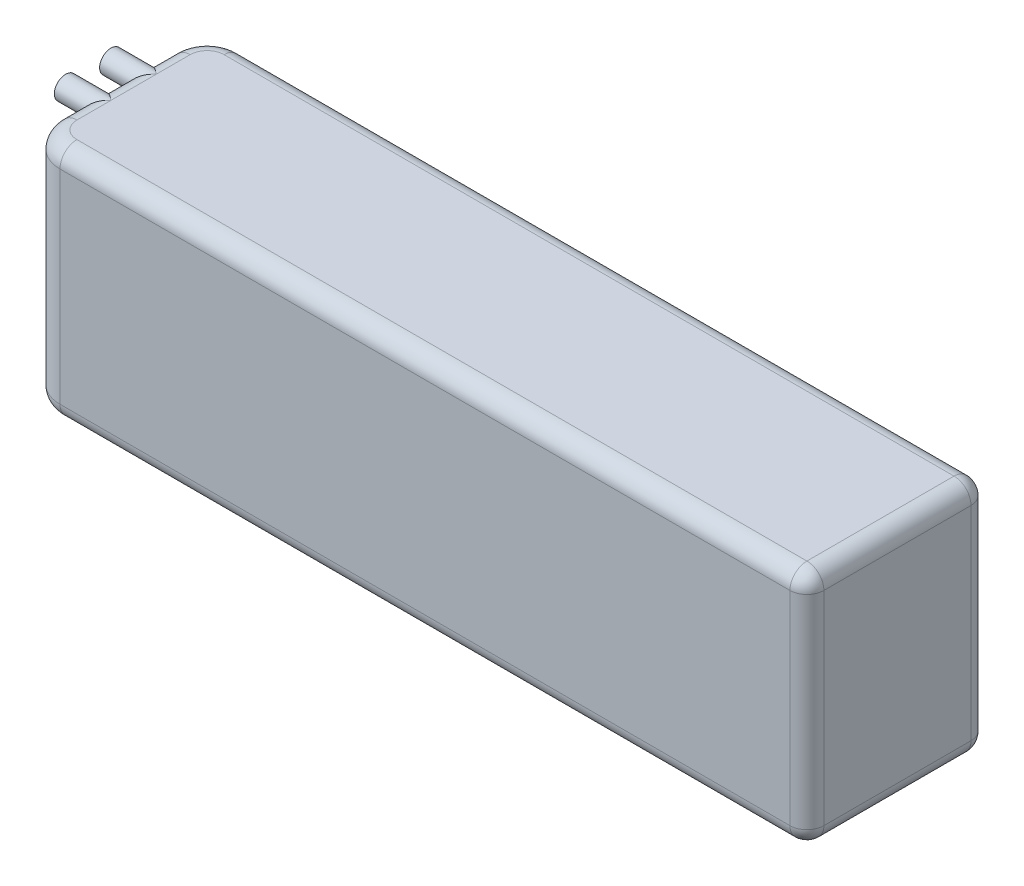
ISO-10303-21;
HEADER;
FILE_DESCRIPTION(('STEP AP214'),'2;1');
FILE_NAME('part.step','',(''),(''),'','','');
FILE_SCHEMA(('AUTOMOTIVE_DESIGN { 1 0 10303 214 1 1 1 1 }'));
ENDSEC;
DATA;
#1=APPLICATION_CONTEXT('core data for automotive mechanical design processes');
#2=APPLICATION_PROTOCOL_DEFINITION('international standard','automotive_design',2000,#1);
#3=PRODUCT_CONTEXT('',#1,'mechanical');
#4=PRODUCT('Part','Part','',(#3));
#5=PRODUCT_RELATED_PRODUCT_CATEGORY('part','',(#4));
#6=PRODUCT_DEFINITION_FORMATION('','',#4);
#7=PRODUCT_DEFINITION_CONTEXT('part definition',#1,'design');
#8=PRODUCT_DEFINITION('design','',#6,#7);
#9=PRODUCT_DEFINITION_SHAPE('','',#8);
#10=(LENGTH_UNIT() NAMED_UNIT(*) SI_UNIT(.MILLI.,.METRE.));
#11=(NAMED_UNIT(*) PLANE_ANGLE_UNIT() SI_UNIT($,.RADIAN.));
#12=(NAMED_UNIT(*) SI_UNIT($,.STERADIAN.) SOLID_ANGLE_UNIT());
#13=UNCERTAINTY_MEASURE_WITH_UNIT(LENGTH_MEASURE(1.E-05),#10,'distance_accuracy_value','');
#14=(GEOMETRIC_REPRESENTATION_CONTEXT(3) GLOBAL_UNCERTAINTY_ASSIGNED_CONTEXT((#13)) GLOBAL_UNIT_ASSIGNED_CONTEXT((#10,
#11,#12)) REPRESENTATION_CONTEXT('',''));
#15=CARTESIAN_POINT('',(0.,0.,0.));
#16=DIRECTION('',(0.,0.,1.));
#17=DIRECTION('',(1.,0.,0.));
#18=AXIS2_PLACEMENT_3D('',#15,#16,#17);
#19=CARTESIAN_POINT('',(0.,42.,0.));
#20=DIRECTION('',(1.,0.,0.));
#21=DIRECTION('',(0.,0.,-1.));
#22=AXIS2_PLACEMENT_3D('',#19,#20,#21);
#23=PLANE('',#22);
#24=DIRECTION('',(0.,-1.,0.));
#25=VECTOR('',#24,1.);
#26=CARTESIAN_POINT('',(0.,42.,-6.));
#27=LINE('',#26,#25);
#28=CARTESIAN_POINT('',(0.,3.,-6.));
#29=VERTEX_POINT('',#28);
#30=CARTESIAN_POINT('',(0.,39.,-6.));
#31=VERTEX_POINT('',#30);
#32=EDGE_CURVE('E599',#29,#31,#27,.F.);
#33=ORIENTED_EDGE('',*,*,#32,.T.);
#34=DIRECTION('',(0.,0.,1.));
#35=VECTOR('',#34,1.);
#36=CARTESIAN_POINT('',(0.,39.,0.));
#37=LINE('',#36,#35);
#38=CARTESIAN_POINT('',(0.,39.,-10.2679491924311));
#39=VERTEX_POINT('',#38);
#40=EDGE_CURVE('E197',#31,#39,#37,.F.);
#41=ORIENTED_EDGE('',*,*,#40,.T.);
#42=CARTESIAN_POINT('',(0.,40.,-12.));
#43=DIRECTION('',(-1.,0.,0.));
#44=DIRECTION('',(0.,0.,1.));
#45=AXIS2_PLACEMENT_3D('',#42,#43,#44);
#46=CIRCLE('',#45,2.);
#47=CARTESIAN_POINT('',(0.,39.,-13.7320508075689));
#48=VERTEX_POINT('',#47);
#49=EDGE_CURVE('E594',#48,#39,#46,.T.);
#50=ORIENTED_EDGE('',*,*,#49,.F.);
#51=DIRECTION('',(0.,0.,1.));
#52=VECTOR('',#51,1.);
#53=CARTESIAN_POINT('',(0.,39.,0.));
#54=LINE('',#53,#52);
#55=CARTESIAN_POINT('',(0.,39.,-18.2679491924311));
#56=VERTEX_POINT('',#55);
#57=EDGE_CURVE('E195',#48,#56,#54,.F.);
#58=ORIENTED_EDGE('',*,*,#57,.T.);
#59=CARTESIAN_POINT('',(0.,40.,-20.));
#60=DIRECTION('',(-1.,0.,0.));
#61=DIRECTION('',(0.,0.,1.));
#62=AXIS2_PLACEMENT_3D('',#59,#60,#61);
#63=CIRCLE('',#62,2.00000000000001);
#64=CARTESIAN_POINT('',(0.,39.,-21.7320508075689));
#65=VERTEX_POINT('',#64);
#66=EDGE_CURVE('E586',#65,#56,#63,.T.);
#67=ORIENTED_EDGE('',*,*,#66,.F.);
#68=DIRECTION('',(0.,0.,1.));
#69=VECTOR('',#68,1.);
#70=CARTESIAN_POINT('',(0.,39.,0.));
#71=LINE('',#70,#69);
#72=CARTESIAN_POINT('',(0.,39.,-26.));
#73=VERTEX_POINT('',#72);
#74=EDGE_CURVE('E193',#65,#73,#71,.F.);
#75=ORIENTED_EDGE('',*,*,#74,.T.);
#76=DIRECTION('',(0.,-1.,0.));
#77=VECTOR('',#76,1.);
#78=CARTESIAN_POINT('',(0.,42.,-26.));
#79=LINE('',#78,#77);
#80=CARTESIAN_POINT('',(0.,3.,-26.));
#81=VERTEX_POINT('',#80);
#82=EDGE_CURVE('E602',#73,#81,#79,.T.);
#83=ORIENTED_EDGE('',*,*,#82,.T.);
#84=DIRECTION('',(0.,0.,1.));
#85=VECTOR('',#84,1.);
#86=CARTESIAN_POINT('',(0.,3.,-6.));
#87=LINE('',#86,#85);
#88=EDGE_CURVE('E191',#81,#29,#87,.T.);
#89=ORIENTED_EDGE('',*,*,#88,.T.);
#90=EDGE_LOOP('',(#33,#41,#50,#58,#67,#75,#83,#89));
#91=FACE_BOUND('',#90,.T.);
#92=ADVANCED_FACE('F36',(#91),#23,.F.);
#93=CARTESIAN_POINT('',(0.,42.,0.));
#94=DIRECTION('',(0.,0.,-1.));
#95=DIRECTION('',(-1.,0.,0.));
#96=AXIS2_PLACEMENT_3D('',#93,#94,#95);
#97=PLANE('',#96);
#98=DIRECTION('',(0.,-1.,0.));
#99=VECTOR('',#98,1.);
#100=CARTESIAN_POINT('',(135.,42.,0.));
#101=LINE('',#100,#99);
#102=CARTESIAN_POINT('',(135.,3.,0.));
#103=VERTEX_POINT('',#102);
#104=CARTESIAN_POINT('',(135.,39.,0.));
#105=VERTEX_POINT('',#104);
#106=EDGE_CURVE('E220',#103,#105,#101,.F.);
#107=ORIENTED_EDGE('',*,*,#106,.T.);
#108=DIRECTION('',(1.,0.,0.));
#109=VECTOR('',#108,1.);
#110=CARTESIAN_POINT('',(0.,39.,0.));
#111=LINE('',#110,#109);
#112=CARTESIAN_POINT('',(6.,39.,0.));
#113=VERTEX_POINT('',#112);
#114=EDGE_CURVE('E222',#105,#113,#111,.F.);
#115=ORIENTED_EDGE('',*,*,#114,.T.);
#116=DIRECTION('',(0.,-1.,0.));
#117=VECTOR('',#116,1.);
#118=CARTESIAN_POINT('',(6.,42.,0.));
#119=LINE('',#118,#117);
#120=CARTESIAN_POINT('',(6.,3.,0.));
#121=VERTEX_POINT('',#120);
#122=EDGE_CURVE('E177',#113,#121,#119,.T.);
#123=ORIENTED_EDGE('',*,*,#122,.T.);
#124=DIRECTION('',(1.,0.,0.));
#125=VECTOR('',#124,1.);
#126=CARTESIAN_POINT('',(138.,3.,0.));
#127=LINE('',#126,#125);
#128=EDGE_CURVE('E218',#121,#103,#127,.T.);
#129=ORIENTED_EDGE('',*,*,#128,.T.);
#130=EDGE_LOOP('',(#107,#115,#123,#129));
#131=FACE_BOUND('',#130,.T.);
#132=ADVANCED_FACE('F300',(#131),#97,.F.);
#133=CARTESIAN_POINT('',(138.,42.,0.));
#134=DIRECTION('',(-1.,0.,0.));
#135=DIRECTION('',(0.,0.,1.));
#136=AXIS2_PLACEMENT_3D('',#133,#134,#135);
#137=PLANE('',#136);
#138=DIRECTION('',(0.,-1.,0.));
#139=VECTOR('',#138,1.);
#140=CARTESIAN_POINT('',(138.,42.,-29.));
#141=LINE('',#140,#139);
#142=CARTESIAN_POINT('',(138.,3.,-29.));
#143=VERTEX_POINT('',#142);
#144=CARTESIAN_POINT('',(138.,39.,-29.));
#145=VERTEX_POINT('',#144);
#146=EDGE_CURVE('E213',#143,#145,#141,.F.);
#147=ORIENTED_EDGE('',*,*,#146,.T.);
#148=DIRECTION('',(0.,0.,-1.));
#149=VECTOR('',#148,1.);
#150=CARTESIAN_POINT('',(138.,39.,0.));
#151=LINE('',#150,#149);
#152=CARTESIAN_POINT('',(138.,39.,-3.));
#153=VERTEX_POINT('',#152);
#154=EDGE_CURVE('E215',#145,#153,#151,.F.);
#155=ORIENTED_EDGE('',*,*,#154,.T.);
#156=DIRECTION('',(0.,-1.,0.));
#157=VECTOR('',#156,1.);
#158=CARTESIAN_POINT('',(138.,42.,-3.));
#159=LINE('',#158,#157);
#160=CARTESIAN_POINT('',(138.,3.,-3.));
#161=VERTEX_POINT('',#160);
#162=EDGE_CURVE('E211',#153,#161,#159,.T.);
#163=ORIENTED_EDGE('',*,*,#162,.T.);
#164=DIRECTION('',(0.,0.,-1.));
#165=VECTOR('',#164,1.);
#166=CARTESIAN_POINT('',(138.,3.,-32.));
#167=LINE('',#166,#165);
#168=EDGE_CURVE('E209',#161,#143,#167,.T.);
#169=ORIENTED_EDGE('',*,*,#168,.T.);
#170=EDGE_LOOP('',(#147,#155,#163,#169));
#171=FACE_BOUND('',#170,.T.);
#172=ADVANCED_FACE('F306',(#171),#137,.F.);
#173=CARTESIAN_POINT('',(0.,42.,-32.));
#174=DIRECTION('',(0.,0.,1.));
#175=DIRECTION('',(1.,0.,0.));
#176=AXIS2_PLACEMENT_3D('',#173,#174,#175);
#177=PLANE('',#176);
#178=DIRECTION('',(0.,-1.,0.));
#179=VECTOR('',#178,1.);
#180=CARTESIAN_POINT('',(6.,42.,-32.));
#181=LINE('',#180,#179);
#182=CARTESIAN_POINT('',(6.,3.,-32.));
#183=VERTEX_POINT('',#182);
#184=CARTESIAN_POINT('',(6.,39.,-32.));
#185=VERTEX_POINT('',#184);
#186=EDGE_CURVE('E605',#183,#185,#181,.F.);
#187=ORIENTED_EDGE('',*,*,#186,.T.);
#188=DIRECTION('',(-1.,0.,0.));
#189=VECTOR('',#188,1.);
#190=CARTESIAN_POINT('',(0.,39.,-32.));
#191=LINE('',#190,#189);
#192=CARTESIAN_POINT('',(135.,39.,-32.));
#193=VERTEX_POINT('',#192);
#194=EDGE_CURVE('E207',#185,#193,#191,.F.);
#195=ORIENTED_EDGE('',*,*,#194,.T.);
#196=DIRECTION('',(0.,-1.,0.));
#197=VECTOR('',#196,1.);
#198=CARTESIAN_POINT('',(135.,42.,-32.));
#199=LINE('',#198,#197);
#200=CARTESIAN_POINT('',(135.,3.,-32.));
#201=VERTEX_POINT('',#200);
#202=EDGE_CURVE('E205',#193,#201,#199,.T.);
#203=ORIENTED_EDGE('',*,*,#202,.T.);
#204=DIRECTION('',(-1.,0.,0.));
#205=VECTOR('',#204,1.);
#206=CARTESIAN_POINT('',(6.,3.,-32.));
#207=LINE('',#206,#205);
#208=EDGE_CURVE('E203',#201,#183,#207,.T.);
#209=ORIENTED_EDGE('',*,*,#208,.T.);
#210=EDGE_LOOP('',(#187,#195,#203,#209));
#211=FACE_BOUND('',#210,.T.);
#212=ADVANCED_FACE('F493',(#211),#177,.F.);
#213=CARTESIAN_POINT('',(0.,42.,0.));
#214=DIRECTION('',(0.,-1.,0.));
#215=DIRECTION('',(0.,0.,-1.));
#216=AXIS2_PLACEMENT_3D('',#213,#214,#215);
#217=PLANE('',#216);
#218=DIRECTION('',(0.,0.,1.));
#219=VECTOR('',#218,1.);
#220=CARTESIAN_POINT('',(3.,42.,0.));
#221=LINE('',#220,#219);
#222=CARTESIAN_POINT('',(3.,42.,-12.));
#223=VERTEX_POINT('',#222);
#224=CARTESIAN_POINT('',(3.,42.,-6.));
#225=VERTEX_POINT('',#224);
#226=EDGE_CURVE('E181',#223,#225,#221,.T.);
#227=ORIENTED_EDGE('',*,*,#226,.T.);
#228=CARTESIAN_POINT('',(6.,42.,-6.));
#229=DIRECTION('',(0.,-1.,0.));
#230=DIRECTION('',(0.,0.,-1.));
#231=AXIS2_PLACEMENT_3D('',#228,#229,#230);
#232=CIRCLE('',#231,3.);
#233=CARTESIAN_POINT('',(6.,42.,-3.));
#234=VERTEX_POINT('',#233);
#235=EDGE_CURVE('E162',#225,#234,#232,.F.);
#236=ORIENTED_EDGE('',*,*,#235,.T.);
#237=DIRECTION('',(1.,0.,0.));
#238=VECTOR('',#237,1.);
#239=CARTESIAN_POINT('',(0.,42.,-3.));
#240=LINE('',#239,#238);
#241=CARTESIAN_POINT('',(135.,42.,-3.));
#242=VERTEX_POINT('',#241);
#243=EDGE_CURVE('E170',#234,#242,#240,.T.);
#244=ORIENTED_EDGE('',*,*,#243,.T.);
#245=DIRECTION('',(0.,0.,-1.));
#246=VECTOR('',#245,1.);
#247=CARTESIAN_POINT('',(135.,42.,0.));
#248=LINE('',#247,#246);
#249=CARTESIAN_POINT('',(135.,42.,-29.));
#250=VERTEX_POINT('',#249);
#251=EDGE_CURVE('E176',#242,#250,#248,.T.);
#252=ORIENTED_EDGE('',*,*,#251,.T.);
#253=DIRECTION('',(-1.,0.,0.));
#254=VECTOR('',#253,1.);
#255=CARTESIAN_POINT('',(0.,42.,-29.));
#256=LINE('',#255,#254);
#257=CARTESIAN_POINT('',(6.,42.,-29.));
#258=VERTEX_POINT('',#257);
#259=EDGE_CURVE('E611',#250,#258,#256,.T.);
#260=ORIENTED_EDGE('',*,*,#259,.T.);
#261=CARTESIAN_POINT('',(6.,42.,-26.));
#262=DIRECTION('',(0.,-1.,0.));
#263=DIRECTION('',(0.,0.,-1.));
#264=AXIS2_PLACEMENT_3D('',#261,#262,#263);
#265=CIRCLE('',#264,3.);
#266=CARTESIAN_POINT('',(3.,42.,-26.));
#267=VERTEX_POINT('',#266);
#268=EDGE_CURVE('E613',#258,#267,#265,.F.);
#269=ORIENTED_EDGE('',*,*,#268,.T.);
#270=DIRECTION('',(0.,0.,1.));
#271=VECTOR('',#270,1.);
#272=CARTESIAN_POINT('',(3.,42.,0.));
#273=LINE('',#272,#271);
#274=CARTESIAN_POINT('',(3.,42.,-20.));
#275=VERTEX_POINT('',#274);
#276=EDGE_CURVE('E615',#267,#275,#273,.T.);
#277=ORIENTED_EDGE('',*,*,#276,.T.);
#278=DIRECTION('',(0.,0.,1.));
#279=VECTOR('',#278,1.);
#280=CARTESIAN_POINT('',(3.,42.,0.));
#281=LINE('',#280,#279);
#282=EDGE_CURVE('E186',#275,#223,#281,.T.);
#283=ORIENTED_EDGE('',*,*,#282,.T.);
#284=EDGE_LOOP('',(#227,#236,#244,#252,#260,#269,#277,#283));
#285=FACE_BOUND('',#284,.T.);
#286=ADVANCED_FACE('F179',(#285),#217,.F.);
#287=CARTESIAN_POINT('',(0.,0.,0.));
#288=DIRECTION('',(0.,-1.,0.));
#289=DIRECTION('',(0.,0.,-1.));
#290=AXIS2_PLACEMENT_3D('',#287,#288,#289);
#291=PLANE('',#290);
#292=DIRECTION('',(1.,0.,0.));
#293=VECTOR('',#292,1.);
#294=CARTESIAN_POINT('',(6.,0.,-3.));
#295=LINE('',#294,#293);
#296=CARTESIAN_POINT('',(135.,0.,-3.));
#297=VERTEX_POINT('',#296);
#298=CARTESIAN_POINT('',(6.,0.,-3.));
#299=VERTEX_POINT('',#298);
#300=EDGE_CURVE('E232',#297,#299,#295,.F.);
#301=ORIENTED_EDGE('',*,*,#300,.T.);
#302=CARTESIAN_POINT('',(6.,0.,-6.));
#303=DIRECTION('',(0.,-1.,0.));
#304=DIRECTION('',(0.,0.,-1.));
#305=AXIS2_PLACEMENT_3D('',#302,#303,#304);
#306=CIRCLE('',#305,3.);
#307=CARTESIAN_POINT('',(3.,0.,-6.));
#308=VERTEX_POINT('',#307);
#309=EDGE_CURVE('E234',#299,#308,#306,.T.);
#310=ORIENTED_EDGE('',*,*,#309,.T.);
#311=DIRECTION('',(0.,0.,1.));
#312=VECTOR('',#311,1.);
#313=CARTESIAN_POINT('',(3.,0.,-26.));
#314=LINE('',#313,#312);
#315=CARTESIAN_POINT('',(3.,0.,-26.));
#316=VERTEX_POINT('',#315);
#317=EDGE_CURVE('E224',#308,#316,#314,.F.);
#318=ORIENTED_EDGE('',*,*,#317,.T.);
#319=CARTESIAN_POINT('',(6.,0.,-26.));
#320=DIRECTION('',(0.,-1.,0.));
#321=DIRECTION('',(0.,0.,-1.));
#322=AXIS2_PLACEMENT_3D('',#319,#320,#321);
#323=CIRCLE('',#322,3.);
#324=CARTESIAN_POINT('',(6.,0.,-29.));
#325=VERTEX_POINT('',#324);
#326=EDGE_CURVE('E226',#316,#325,#323,.T.);
#327=ORIENTED_EDGE('',*,*,#326,.T.);
#328=DIRECTION('',(-1.,0.,0.));
#329=VECTOR('',#328,1.);
#330=CARTESIAN_POINT('',(138.,0.,-29.));
#331=LINE('',#330,#329);
#332=CARTESIAN_POINT('',(135.,0.,-29.));
#333=VERTEX_POINT('',#332);
#334=EDGE_CURVE('E228',#325,#333,#331,.F.);
#335=ORIENTED_EDGE('',*,*,#334,.T.);
#336=DIRECTION('',(0.,0.,-1.));
#337=VECTOR('',#336,1.);
#338=CARTESIAN_POINT('',(135.,0.,0.));
#339=LINE('',#338,#337);
#340=EDGE_CURVE('E230',#333,#297,#339,.F.);
#341=ORIENTED_EDGE('',*,*,#340,.T.);
#342=EDGE_LOOP('',(#301,#310,#318,#327,#335,#341));
#343=FACE_BOUND('',#342,.T.);
#344=ADVANCED_FACE('F296',(#343),#291,.T.);
#345=CARTESIAN_POINT('',(-5.,40.,-12.));
#346=DIRECTION('',(1.,0.,0.));
#347=DIRECTION('',(0.,0.,-1.));
#348=AXIS2_PLACEMENT_3D('',#345,#346,#347);
#349=CYLINDRICAL_SURFACE('',#348,2.);
#350=CARTESIAN_POINT('',(-5.,40.,-12.));
#351=DIRECTION('',(-1.,0.,0.));
#352=DIRECTION('',(0.,0.,1.));
#353=AXIS2_PLACEMENT_3D('',#350,#351,#352);
#354=CIRCLE('',#353,2.);
#355=CARTESIAN_POINT('',(-5.,40.,-10.));
#356=VERTEX_POINT('',#355);
#357=EDGE_CURVE('E597',#356,#356,#354,.T.);
#358=ORIENTED_EDGE('',*,*,#357,.F.);
#359=EDGE_LOOP('',(#358));
#360=FACE_BOUND('',#359,.T.);
#361=CARTESIAN_POINT('',(0.,39.,-10.2679491924311));
#362=CARTESIAN_POINT('',(-6.30603423343954E-06,39.042172199435,-10.2435921961484));
#363=CARTESIAN_POINT('',(0.000889185220809398,39.0852460182739,-10.2207862755647));
#364=CARTESIAN_POINT('',(0.00466564900762788,39.1728763451701,-10.1783996086181));
#365=CARTESIAN_POINT('',(0.00754696337859954,39.2174331072439,-10.1588194182508));
#366=CARTESIAN_POINT('',(0.0154668323512276,39.3075772992539,-10.1230620100822));
#367=CARTESIAN_POINT('',(0.0204997883009923,39.3531617654729,-10.1068761219788));
#368=CARTESIAN_POINT('',(0.0328368121389329,39.4450828156501,-10.0779195699587));
#369=CARTESIAN_POINT('',(0.0401406284663025,39.491419315761,-10.0651485280444));
#370=CARTESIAN_POINT('',(0.0656225337697166,39.6311564812278,-10.0319816086804));
#371=CARTESIAN_POINT('',(0.0873652604392566,39.7252138316281,-10.0167598087384));
#372=CARTESIAN_POINT('',(0.140261324363799,39.9117666650803,-9.9997471472951));
#373=CARTESIAN_POINT('',(0.171412954859758,40.004262428191,-9.99795385140647));
#374=CARTESIAN_POINT('',(0.242517570779985,40.1856754776476,-10.0065582210649));
#375=CARTESIAN_POINT('',(0.282511695981795,40.2745736603208,-10.0170138860998));
#376=CARTESIAN_POINT('',(0.370031728466312,40.4465856920533,-10.048531994061));
#377=CARTESIAN_POINT('',(0.417564206028557,40.529694403327,-10.0696037249413));
#378=CARTESIAN_POINT('',(0.542366344368047,40.7260074276393,-10.1324084523741));
#379=CARTESIAN_POINT('',(0.623214874652051,40.8353302152878,-10.1791904855663));
#380=CARTESIAN_POINT('',(0.79470954724899,41.0382448423806,-10.2867301871516));
#381=CARTESIAN_POINT('',(0.885374583299787,41.1318054274772,-10.3475150695353));
#382=CARTESIAN_POINT('',(1.11057432539633,41.3369815020696,-10.5049640591339));
#383=CARTESIAN_POINT('',(1.24839266933246,41.4413356213455,-10.6063604477779));
#384=CARTESIAN_POINT('',(1.53256927600156,41.6220421371788,-10.8215359630869));
#385=CARTESIAN_POINT('',(1.67894549755798,41.6983330056314,-10.935341597384));
#386=CARTESIAN_POINT('',(1.92232115641689,41.8016296396285,-11.1274811700311));
#387=CARTESIAN_POINT('',(2.01784836145289,41.8364613087322,-11.203605668313));
#388=CARTESIAN_POINT('',(2.21034290379819,41.8959634676856,-11.3579906000983));
#389=CARTESIAN_POINT('',(2.30731079872236,41.9206299110496,-11.4362518709976));
#390=CARTESIAN_POINT('',(2.59912966390285,41.9796990806142,-11.6726980616841));
#391=CARTESIAN_POINT('',(2.7955306952544,41.9994340462293,-11.8330516147133));
#392=CARTESIAN_POINT('',(2.99434323397275,41.9999959948454,-11.9953812719093));
#393=CARTESIAN_POINT('',(2.99717166415688,41.9999999944344,-11.997690675531));
#394=CARTESIAN_POINT('',(3.,42.,-12.));
#395=B_SPLINE_CURVE_WITH_KNOTS('',3,(#361,#362,#363,#364,#365,#366,#367,#368,#369,#370,#371,
#372,#373,#374,#375,#376,#377,#378,#379,#380,#381,#382,#383,#384,#385,#386,#387,#388,#389,#390,
#391,#392,#393,#394),.UNSPECIFIED.,.F.,.F.,(4,2,2,2,2,2,2,2,2,2,2,2,2,2,2,2,4),(0.,
0.146067983307109,0.292161117009973,0.437876402742218,0.583575552210654,0.875200242344444,
1.16677206399752,1.45973009279534,1.75294487567456,2.18191721254923,2.61173038072263,
3.20973458974961,3.80904220453404,4.1896673454372,4.57044385631551,5.32946303346184,
5.34041749118465),.UNSPECIFIED.);
#396=EDGE_CURVE('E59',#39,#223,#395,.T.);
#397=ORIENTED_EDGE('',*,*,#396,.T.);
#398=CARTESIAN_POINT('',(0.,39.,-13.7320508075689));
#399=CARTESIAN_POINT('',(-6.30603423372292E-06,39.042172199435,-13.7564078038516));
#400=CARTESIAN_POINT('',(0.000889185220809137,39.0852460182739,-13.7792137244353));
#401=CARTESIAN_POINT('',(0.00466564900762787,39.1728763451701,-13.8216003913819));
#402=CARTESIAN_POINT('',(0.00754696337859958,39.2174331072439,-13.8411805817492));
#403=CARTESIAN_POINT('',(0.0154668323512276,39.3075772992539,-13.8769379899178));
#404=CARTESIAN_POINT('',(0.0204997883009924,39.3531617654729,-13.8931238780212));
#405=CARTESIAN_POINT('',(0.032836812138933,39.4450828156501,-13.9220804300413));
#406=CARTESIAN_POINT('',(0.0401406284663026,39.491419315761,-13.9348514719556));
#407=CARTESIAN_POINT('',(0.0656225337697168,39.6311564812278,-13.9680183913196));
#408=CARTESIAN_POINT('',(0.0873652604392566,39.7252138316281,-13.9832401912616));
#409=CARTESIAN_POINT('',(0.140261324363799,39.9117666650803,-14.0002528527049));
#410=CARTESIAN_POINT('',(0.171412954859758,40.004262428191,-14.0020461485935));
#411=CARTESIAN_POINT('',(0.242517570779985,40.1856754776476,-13.9934417789351));
#412=CARTESIAN_POINT('',(0.282511695981794,40.2745736603208,-13.9829861139002));
#413=CARTESIAN_POINT('',(0.37003172846631,40.4465856920533,-13.951468005939));
#414=CARTESIAN_POINT('',(0.417564206028555,40.529694403327,-13.9303962750587));
#415=CARTESIAN_POINT('',(0.542366344368047,40.7260074276393,-13.8675915476259));
#416=CARTESIAN_POINT('',(0.623214874652051,40.8353302152878,-13.8208095144337));
#417=CARTESIAN_POINT('',(0.79470954724899,41.0382448423806,-13.7132698128484));
#418=CARTESIAN_POINT('',(0.885374583299787,41.1318054274772,-13.6524849304647));
#419=CARTESIAN_POINT('',(1.11057432539633,41.3369815020696,-13.4950359408661));
#420=CARTESIAN_POINT('',(1.24839266933246,41.4413356213455,-13.3936395522221));
#421=CARTESIAN_POINT('',(1.53256927600156,41.6220421371788,-13.1784640369131));
#422=CARTESIAN_POINT('',(1.67894549755798,41.6983330056314,-13.064658402616));
#423=CARTESIAN_POINT('',(1.9223211564169,41.8016296396285,-12.8725188299689));
#424=CARTESIAN_POINT('',(2.0178483614529,41.8364613087322,-12.796394331687));
#425=CARTESIAN_POINT('',(2.21034290379819,41.8959634676856,-12.6420093999017));
#426=CARTESIAN_POINT('',(2.30731079872236,41.9206299110496,-12.5637481290024));
#427=CARTESIAN_POINT('',(2.59912966390285,41.9796990806142,-12.3273019383159));
#428=CARTESIAN_POINT('',(2.79553069525441,41.9994340462293,-12.1669483852867));
#429=CARTESIAN_POINT('',(2.99434323397275,41.9999959948454,-12.0046187280907));
#430=CARTESIAN_POINT('',(2.99717166415688,41.9999999944344,-12.002309324469));
#431=CARTESIAN_POINT('',(3.,42.,-12.));
#432=B_SPLINE_CURVE_WITH_KNOTS('',3,(#398,#399,#400,#401,#402,#403,#404,#405,#406,#407,#408,
#409,#410,#411,#412,#413,#414,#415,#416,#417,#418,#419,#420,#421,#422,#423,#424,#425,#426,#427,
#428,#429,#430,#431),.UNSPECIFIED.,.F.,.F.,(4,2,2,2,2,2,2,2,2,2,2,2,2,2,2,2,4),(0.,
0.146067983307115,0.292161117009972,0.437876402742218,0.583575552210653,0.875200242344444,
1.16677206399752,1.45973009279533,1.75294487567456,2.18191721254923,2.61173038072263,
3.20973458974961,3.80904220453404,4.1896673454372,4.57044385631551,5.32946303346184,
5.34041749118464),.UNSPECIFIED.);
#433=EDGE_CURVE('E244',#223,#48,#432,.F.);
#434=ORIENTED_EDGE('',*,*,#433,.T.);
#435=ORIENTED_EDGE('',*,*,#49,.T.);
#436=EDGE_LOOP('',(#397,#434,#435));
#437=FACE_BOUND('',#436,.T.);
#438=ADVANCED_FACE('F251',(#360,#437),#349,.T.);
#439=CARTESIAN_POINT('',(-5.,40.,-12.));
#440=DIRECTION('',(-1.,0.,0.));
#441=DIRECTION('',(0.,0.,1.));
#442=AXIS2_PLACEMENT_3D('',#439,#440,#441);
#443=PLANE('',#442);
#444=ORIENTED_EDGE('',*,*,#357,.T.);
#445=EDGE_LOOP('',(#444));
#446=FACE_BOUND('',#445,.T.);
#447=ADVANCED_FACE('F288',(#446),#443,.T.);
#448=CARTESIAN_POINT('',(-5.,40.,-20.));
#449=DIRECTION('',(1.,0.,0.));
#450=DIRECTION('',(0.,0.,-1.));
#451=AXIS2_PLACEMENT_3D('',#448,#449,#450);
#452=CYLINDRICAL_SURFACE('',#451,2.00000000000001);
#453=CARTESIAN_POINT('',(-5.,40.,-20.));
#454=DIRECTION('',(-1.,0.,0.));
#455=DIRECTION('',(0.,0.,1.));
#456=AXIS2_PLACEMENT_3D('',#453,#454,#455);
#457=CIRCLE('',#456,2.00000000000001);
#458=CARTESIAN_POINT('',(-5.,40.,-18.));
#459=VERTEX_POINT('',#458);
#460=EDGE_CURVE('E590',#459,#459,#457,.T.);
#461=ORIENTED_EDGE('',*,*,#460,.F.);
#462=EDGE_LOOP('',(#461));
#463=FACE_BOUND('',#462,.T.);
#464=CARTESIAN_POINT('',(0.,39.,-18.2679491924311));
#465=CARTESIAN_POINT('',(-6.30603423357262E-06,39.042172199435,-18.2435921961484));
#466=CARTESIAN_POINT('',(0.000889185220808984,39.0852460182739,-18.2207862755647));
#467=CARTESIAN_POINT('',(0.00466564900762661,39.1728763451701,-18.1783996086181));
#468=CARTESIAN_POINT('',(0.00754696337859773,39.2174331072439,-18.1588194182508));
#469=CARTESIAN_POINT('',(0.015466832351225,39.3075772992539,-18.1230620100822));
#470=CARTESIAN_POINT('',(0.0204997883009898,39.3531617654728,-18.1068761219788));
#471=CARTESIAN_POINT('',(0.0328368121389311,39.44508281565,-18.0779195699587));
#472=CARTESIAN_POINT('',(0.0401406284663015,39.491419315761,-18.0651485280444));
#473=CARTESIAN_POINT('',(0.0656225337697176,39.6311564812278,-18.0319816086804));
#474=CARTESIAN_POINT('',(0.0873652604392587,39.7252138316281,-18.0167598087384));
#475=CARTESIAN_POINT('',(0.140261324363803,39.9117666650803,-17.9997471472951));
#476=CARTESIAN_POINT('',(0.17141295485976,40.004262428191,-17.9979538514065));
#477=CARTESIAN_POINT('',(0.242517570779978,40.1856754776476,-18.0065582210648));
#478=CARTESIAN_POINT('',(0.28251169598178,40.2745736603208,-18.0170138860998));
#479=CARTESIAN_POINT('',(0.370031728466295,40.4465856920532,-18.0485319940609));
#480=CARTESIAN_POINT('',(0.417564206028547,40.529694403327,-18.0696037249413));
#481=CARTESIAN_POINT('',(0.542366344368073,40.7260074276394,-18.1324084523741));
#482=CARTESIAN_POINT('',(0.62321487465211,40.8353302152879,-18.1791904855663));
#483=CARTESIAN_POINT('',(0.794709547249045,41.0382448423806,-18.2867301871516));
#484=CARTESIAN_POINT('',(0.885374583299798,41.1318054274773,-18.3475150695353));
#485=CARTESIAN_POINT('',(1.11057432539629,41.3369815020695,-18.5049640591338));
#486=CARTESIAN_POINT('',(1.24839266933245,41.4413356213454,-18.6063604477776));
#487=CARTESIAN_POINT('',(1.53256927600128,41.6220421371788,-18.8215359630869));
#488=CARTESIAN_POINT('',(1.67894549755743,41.6983330056314,-18.9353415973845));
#489=CARTESIAN_POINT('',(1.92232115641723,41.8016296396285,-19.1274811700308));
#490=CARTESIAN_POINT('',(2.01784836145389,41.8364613087322,-19.2036056683118));
#491=CARTESIAN_POINT('',(2.21034290379733,41.8959634676857,-19.3579906000995));
#492=CARTESIAN_POINT('',(2.30731079871897,41.9206299110496,-19.436251871002));
#493=CARTESIAN_POINT('',(2.59912966391002,41.9796990806142,-19.6726980616756));
#494=CARTESIAN_POINT('',(2.79553069529278,41.9994340462293,-19.8330516146664));
#495=CARTESIAN_POINT('',(2.99434323397386,41.9999959948454,-19.9953812719079));
#496=CARTESIAN_POINT('',(2.99717166415744,41.9999999944345,-19.9976906755303));
#497=CARTESIAN_POINT('',(3.,42.,-20.));
#498=B_SPLINE_CURVE_WITH_KNOTS('',3,(#464,#465,#466,#467,#468,#469,#470,#471,#472,#473,#474,
#475,#476,#477,#478,#479,#480,#481,#482,#483,#484,#485,#486,#487,#488,#489,#490,#491,#492,#493,
#494,#495,#496,#497),.UNSPECIFIED.,.F.,.F.,(4,2,2,2,2,2,2,2,2,2,2,2,2,2,2,2,4),(0.,
0.146067983307093,0.292161117009942,0.437876402742196,0.583575552210653,0.875200242344465,
1.16677206399751,1.45973009279529,1.75294487567456,2.18191721254937,2.61173038072264,
3.2097345897493,3.80904220453405,4.18966734543726,4.57044385631574,5.32946303346185,
5.34041749118466),.UNSPECIFIED.);
#499=EDGE_CURVE('E45',#56,#275,#498,.T.);
#500=ORIENTED_EDGE('',*,*,#499,.T.);
#501=CARTESIAN_POINT('',(0.,39.,-21.7320508075689));
#502=CARTESIAN_POINT('',(-6.30603423361722E-06,39.042172199435,-21.7564078038516));
#503=CARTESIAN_POINT('',(0.000889185220808914,39.0852460182739,-21.7792137244353));
#504=CARTESIAN_POINT('',(0.00466564900762652,39.1728763451701,-21.8216003913819));
#505=CARTESIAN_POINT('',(0.00754696337859764,39.2174331072439,-21.8411805817492));
#506=CARTESIAN_POINT('',(0.0154668323512249,39.3075772992539,-21.8769379899178));
#507=CARTESIAN_POINT('',(0.0204997883009898,39.3531617654728,-21.8931238780212));
#508=CARTESIAN_POINT('',(0.0328368121389311,39.44508281565,-21.9220804300413));
#509=CARTESIAN_POINT('',(0.0401406284663015,39.491419315761,-21.9348514719556));
#510=CARTESIAN_POINT('',(0.0656225337697176,39.6311564812278,-21.9680183913196));
#511=CARTESIAN_POINT('',(0.0873652604392587,39.7252138316281,-21.9832401912616));
#512=CARTESIAN_POINT('',(0.140261324363803,39.9117666650803,-22.0002528527049));
#513=CARTESIAN_POINT('',(0.17141295485976,40.004262428191,-22.0020461485935));
#514=CARTESIAN_POINT('',(0.242517570779978,40.1856754776476,-21.9934417789352));
#515=CARTESIAN_POINT('',(0.28251169598178,40.2745736603208,-21.9829861139002));
#516=CARTESIAN_POINT('',(0.370031728466295,40.4465856920532,-21.9514680059391));
#517=CARTESIAN_POINT('',(0.417564206028547,40.529694403327,-21.9303962750587));
#518=CARTESIAN_POINT('',(0.542366344368073,40.7260074276394,-21.8675915476259));
#519=CARTESIAN_POINT('',(0.62321487465211,40.8353302152879,-21.8208095144337));
#520=CARTESIAN_POINT('',(0.794709547249045,41.0382448423806,-21.7132698128484));
#521=CARTESIAN_POINT('',(0.885374583299799,41.1318054274773,-21.6524849304647));
#522=CARTESIAN_POINT('',(1.11057432539629,41.3369815020695,-21.4950359408662));
#523=CARTESIAN_POINT('',(1.24839266933245,41.4413356213454,-21.3936395522224));
#524=CARTESIAN_POINT('',(1.53256927600128,41.6220421371788,-21.1784640369131));
#525=CARTESIAN_POINT('',(1.67894549755742,41.6983330056314,-21.0646584026155));
#526=CARTESIAN_POINT('',(1.92232115641723,41.8016296396285,-20.8725188299693));
#527=CARTESIAN_POINT('',(2.01784836145389,41.8364613087322,-20.7963943316882));
#528=CARTESIAN_POINT('',(2.21034290379732,41.8959634676857,-20.6420093999005));
#529=CARTESIAN_POINT('',(2.30731079871897,41.9206299110496,-20.563748128998));
#530=CARTESIAN_POINT('',(2.59912966391002,41.9796990806142,-20.3273019383244));
#531=CARTESIAN_POINT('',(2.79553069529278,41.9994340462293,-20.1669483853336));
#532=CARTESIAN_POINT('',(2.99434323397386,41.9999959948454,-20.0046187280921));
#533=CARTESIAN_POINT('',(2.99717166415744,41.9999999944345,-20.0023093244697));
#534=CARTESIAN_POINT('',(3.,42.,-20.));
#535=B_SPLINE_CURVE_WITH_KNOTS('',3,(#501,#502,#503,#504,#505,#506,#507,#508,#509,#510,#511,
#512,#513,#514,#515,#516,#517,#518,#519,#520,#521,#522,#523,#524,#525,#526,#527,#528,#529,#530,
#531,#532,#533,#534),.UNSPECIFIED.,.F.,.F.,(4,2,2,2,2,2,2,2,2,2,2,2,2,2,2,2,4),(0.,
0.146067983307093,0.292161117009942,0.437876402742196,0.583575552210653,0.875200242344465,
1.16677206399751,1.45973009279529,1.75294487567456,2.18191721254937,2.61173038072264,
3.2097345897493,3.80904220453405,4.18966734543726,4.57044385631573,5.32946303346185,
5.34041749118466),.UNSPECIFIED.);
#536=EDGE_CURVE('E11',#275,#65,#535,.F.);
#537=ORIENTED_EDGE('',*,*,#536,.T.);
#538=ORIENTED_EDGE('',*,*,#66,.T.);
#539=EDGE_LOOP('',(#500,#537,#538));
#540=FACE_BOUND('',#539,.T.);
#541=ADVANCED_FACE('F283',(#463,#540),#452,.T.);
#542=CARTESIAN_POINT('',(-5.,40.,-20.));
#543=DIRECTION('',(-1.,0.,0.));
#544=DIRECTION('',(0.,0.,1.));
#545=AXIS2_PLACEMENT_3D('',#542,#543,#544);
#546=PLANE('',#545);
#547=ORIENTED_EDGE('',*,*,#460,.T.);
#548=EDGE_LOOP('',(#547));
#549=FACE_BOUND('',#548,.T.);
#550=ADVANCED_FACE('F287',(#549),#546,.T.);
#551=CARTESIAN_POINT('',(6.,42.,-26.));
#552=DIRECTION('',(0.,-1.,0.));
#553=DIRECTION('',(0.,0.,-1.));
#554=AXIS2_PLACEMENT_3D('',#551,#552,#553);
#555=CYLINDRICAL_SURFACE('',#554,6.);
#556=ORIENTED_EDGE('',*,*,#82,.F.);
#557=CARTESIAN_POINT('',(6.,39.,-26.));
#558=DIRECTION('',(0.,-1.,0.));
#559=DIRECTION('',(0.,0.,-1.));
#560=AXIS2_PLACEMENT_3D('',#557,#558,#559);
#561=CIRCLE('',#560,6.);
#562=EDGE_CURVE('E201',#73,#185,#561,.T.);
#563=ORIENTED_EDGE('',*,*,#562,.T.);
#564=ORIENTED_EDGE('',*,*,#186,.F.);
#565=CARTESIAN_POINT('',(6.,3.,-26.));
#566=DIRECTION('',(0.,-1.,0.));
#567=DIRECTION('',(0.,0.,-1.));
#568=AXIS2_PLACEMENT_3D('',#565,#566,#567);
#569=CIRCLE('',#568,6.);
#570=EDGE_CURVE('E199',#183,#81,#569,.F.);
#571=ORIENTED_EDGE('',*,*,#570,.T.);
#572=EDGE_LOOP('',(#556,#563,#564,#571));
#573=FACE_BOUND('',#572,.T.);
#574=ADVANCED_FACE('F312',(#573),#555,.T.);
#575=CARTESIAN_POINT('',(6.,42.,-6.));
#576=DIRECTION('',(0.,-1.,0.));
#577=DIRECTION('',(0.,0.,-1.));
#578=AXIS2_PLACEMENT_3D('',#575,#576,#577);
#579=CYLINDRICAL_SURFACE('',#578,6.);
#580=ORIENTED_EDGE('',*,*,#122,.F.);
#581=CARTESIAN_POINT('',(6.,39.,-6.));
#582=DIRECTION('',(0.,-1.,0.));
#583=DIRECTION('',(0.,0.,-1.));
#584=AXIS2_PLACEMENT_3D('',#581,#582,#583);
#585=CIRCLE('',#584,6.);
#586=EDGE_CURVE('E164',#113,#31,#585,.T.);
#587=ORIENTED_EDGE('',*,*,#586,.T.);
#588=ORIENTED_EDGE('',*,*,#32,.F.);
#589=CARTESIAN_POINT('',(6.,3.,-6.));
#590=DIRECTION('',(0.,-1.,0.));
#591=DIRECTION('',(0.,0.,-1.));
#592=AXIS2_PLACEMENT_3D('',#589,#590,#591);
#593=CIRCLE('',#592,6.);
#594=EDGE_CURVE('E183',#29,#121,#593,.F.);
#595=ORIENTED_EDGE('',*,*,#594,.T.);
#596=EDGE_LOOP('',(#580,#587,#588,#595));
#597=FACE_BOUND('',#596,.T.);
#598=ADVANCED_FACE('F315',(#597),#579,.T.);
#599=CARTESIAN_POINT('',(6.,3.,-26.));
#600=DIRECTION('',(0.,-1.,0.));
#601=DIRECTION('',(0.,0.,-1.));
#602=AXIS2_PLACEMENT_3D('',#599,#600,#601);
#603=DEGENERATE_TOROIDAL_SURFACE('',#602,3.,3.,.T.);
#604=CARTESIAN_POINT('',(3.,3.,-26.));
#605=DIRECTION('',(0.,0.,1.));
#606=DIRECTION('',(1.,0.,0.));
#607=AXIS2_PLACEMENT_3D('',#604,#605,#606);
#608=CIRCLE('',#607,3.);
#609=EDGE_CURVE('E580',#81,#316,#608,.T.);
#610=ORIENTED_EDGE('',*,*,#609,.F.);
#611=ORIENTED_EDGE('',*,*,#570,.F.);
#612=CARTESIAN_POINT('',(6.,3.,-29.));
#613=DIRECTION('',(1.,0.,0.));
#614=DIRECTION('',(0.,0.,-1.));
#615=AXIS2_PLACEMENT_3D('',#612,#613,#614);
#616=CIRCLE('',#615,3.);
#617=EDGE_CURVE('E40',#325,#183,#616,.T.);
#618=ORIENTED_EDGE('',*,*,#617,.F.);
#619=ORIENTED_EDGE('',*,*,#326,.F.);
#620=EDGE_LOOP('',(#610,#611,#618,#619));
#621=FACE_BOUND('',#620,.T.);
#622=ADVANCED_FACE('F38',(#621),#603,.T.);
#623=CARTESIAN_POINT('',(0.,3.,-29.));
#624=DIRECTION('',(1.,0.,0.));
#625=DIRECTION('',(0.,0.,-1.));
#626=AXIS2_PLACEMENT_3D('',#623,#624,#625);
#627=CYLINDRICAL_SURFACE('',#626,3.);
#628=ORIENTED_EDGE('',*,*,#617,.T.);
#629=ORIENTED_EDGE('',*,*,#208,.F.);
#630=CARTESIAN_POINT('',(135.,3.,-29.));
#631=DIRECTION('',(1.,0.,0.));
#632=DIRECTION('',(0.,0.,-1.));
#633=AXIS2_PLACEMENT_3D('',#630,#631,#632);
#634=CIRCLE('',#633,3.);
#635=EDGE_CURVE('E578',#333,#201,#634,.T.);
#636=ORIENTED_EDGE('',*,*,#635,.F.);
#637=ORIENTED_EDGE('',*,*,#334,.F.);
#638=EDGE_LOOP('',(#628,#629,#636,#637));
#639=FACE_BOUND('',#638,.T.);
#640=ADVANCED_FACE('F436',(#639),#627,.T.);
#641=CARTESIAN_POINT('',(3.,3.,0.));
#642=DIRECTION('',(0.,0.,-1.));
#643=DIRECTION('',(-1.,0.,0.));
#644=AXIS2_PLACEMENT_3D('',#641,#642,#643);
#645=CYLINDRICAL_SURFACE('',#644,3.);
#646=ORIENTED_EDGE('',*,*,#609,.T.);
#647=ORIENTED_EDGE('',*,*,#317,.F.);
#648=CARTESIAN_POINT('',(3.,3.,-6.));
#649=DIRECTION('',(0.,0.,1.));
#650=DIRECTION('',(1.,0.,0.));
#651=AXIS2_PLACEMENT_3D('',#648,#649,#650);
#652=CIRCLE('',#651,3.);
#653=EDGE_CURVE('E576',#29,#308,#652,.T.);
#654=ORIENTED_EDGE('',*,*,#653,.F.);
#655=ORIENTED_EDGE('',*,*,#88,.F.);
#656=EDGE_LOOP('',(#646,#647,#654,#655));
#657=FACE_BOUND('',#656,.T.);
#658=ADVANCED_FACE('F428',(#657),#645,.T.);
#659=CARTESIAN_POINT('',(135.,3.,-29.));
#660=DIRECTION('',(0.,0.,1.));
#661=DIRECTION('',(1.,0.,0.));
#662=AXIS2_PLACEMENT_3D('',#659,#660,#661);
#663=SPHERICAL_SURFACE('',#662,3.);
#664=CARTESIAN_POINT('',(135.,3.,-29.));
#665=DIRECTION('',(0.,0.,-1.));
#666=DIRECTION('',(-1.,0.,0.));
#667=AXIS2_PLACEMENT_3D('',#664,#665,#666);
#668=CIRCLE('',#667,3.);
#669=EDGE_CURVE('E558',#333,#143,#668,.F.);
#670=ORIENTED_EDGE('',*,*,#669,.F.);
#671=ORIENTED_EDGE('',*,*,#635,.T.);
#672=CARTESIAN_POINT('',(135.,3.,-29.));
#673=DIRECTION('',(0.,-1.,0.));
#674=DIRECTION('',(0.,0.,-1.));
#675=AXIS2_PLACEMENT_3D('',#672,#673,#674);
#676=CIRCLE('',#675,3.);
#677=EDGE_CURVE('E574',#143,#201,#676,.F.);
#678=ORIENTED_EDGE('',*,*,#677,.F.);
#679=EDGE_LOOP('',(#670,#671,#678));
#680=FACE_BOUND('',#679,.T.);
#681=ADVANCED_FACE('F420',(#680),#663,.T.);
#682=CARTESIAN_POINT('',(6.,3.,-6.));
#683=DIRECTION('',(0.,-1.,0.));
#684=DIRECTION('',(0.,0.,-1.));
#685=AXIS2_PLACEMENT_3D('',#682,#683,#684);
#686=DEGENERATE_TOROIDAL_SURFACE('',#685,3.,3.,.T.);
#687=ORIENTED_EDGE('',*,*,#653,.T.);
#688=ORIENTED_EDGE('',*,*,#309,.F.);
#689=CARTESIAN_POINT('',(6.,3.,-3.));
#690=DIRECTION('',(1.,0.,0.));
#691=DIRECTION('',(0.,0.,-1.));
#692=AXIS2_PLACEMENT_3D('',#689,#690,#691);
#693=CIRCLE('',#692,3.);
#694=EDGE_CURVE('E570',#121,#299,#693,.T.);
#695=ORIENTED_EDGE('',*,*,#694,.F.);
#696=ORIENTED_EDGE('',*,*,#594,.F.);
#697=EDGE_LOOP('',(#687,#688,#695,#696));
#698=FACE_BOUND('',#697,.T.);
#699=ADVANCED_FACE('F412',(#698),#686,.T.);
#700=CARTESIAN_POINT('',(0.,39.,-29.));
#701=DIRECTION('',(-1.,0.,0.));
#702=DIRECTION('',(0.,0.,1.));
#703=AXIS2_PLACEMENT_3D('',#700,#701,#702);
#704=CYLINDRICAL_SURFACE('',#703,3.);
#705=CARTESIAN_POINT('',(135.,39.,-29.));
#706=DIRECTION('',(1.,0.,0.));
#707=DIRECTION('',(0.,1.,0.));
#708=AXIS2_PLACEMENT_3D('',#705,#706,#707);
#709=CIRCLE('',#708,3.);
#710=EDGE_CURVE('E535',#193,#250,#709,.T.);
#711=ORIENTED_EDGE('',*,*,#710,.F.);
#712=ORIENTED_EDGE('',*,*,#194,.F.);
#713=CARTESIAN_POINT('',(6.,39.,-29.));
#714=DIRECTION('',(-1.,0.,0.));
#715=DIRECTION('',(0.,0.,1.));
#716=AXIS2_PLACEMENT_3D('',#713,#714,#715);
#717=CIRCLE('',#716,3.);
#718=EDGE_CURVE('E567',#258,#185,#717,.T.);
#719=ORIENTED_EDGE('',*,*,#718,.F.);
#720=ORIENTED_EDGE('',*,*,#259,.F.);
#721=EDGE_LOOP('',(#711,#712,#719,#720));
#722=FACE_BOUND('',#721,.T.);
#723=ADVANCED_FACE('F404',(#722),#704,.T.);
#724=CARTESIAN_POINT('',(135.,42.,-29.));
#725=DIRECTION('',(0.,-1.,0.));
#726=DIRECTION('',(0.,0.,-1.));
#727=AXIS2_PLACEMENT_3D('',#724,#725,#726);
#728=CYLINDRICAL_SURFACE('',#727,3.);
#729=ORIENTED_EDGE('',*,*,#677,.T.);
#730=ORIENTED_EDGE('',*,*,#202,.F.);
#731=CARTESIAN_POINT('',(135.,39.,-29.));
#732=DIRECTION('',(0.,1.,0.));
#733=DIRECTION('',(0.,0.,1.));
#734=AXIS2_PLACEMENT_3D('',#731,#732,#733);
#735=CIRCLE('',#734,3.);
#736=EDGE_CURVE('E531',#145,#193,#735,.T.);
#737=ORIENTED_EDGE('',*,*,#736,.F.);
#738=ORIENTED_EDGE('',*,*,#146,.F.);
#739=EDGE_LOOP('',(#729,#730,#737,#738));
#740=FACE_BOUND('',#739,.T.);
#741=ADVANCED_FACE('F396',(#740),#728,.T.);
#742=CARTESIAN_POINT('',(135.,3.,0.));
#743=DIRECTION('',(0.,0.,1.));
#744=DIRECTION('',(1.,0.,0.));
#745=AXIS2_PLACEMENT_3D('',#742,#743,#744);
#746=CYLINDRICAL_SURFACE('',#745,3.);
#747=ORIENTED_EDGE('',*,*,#669,.T.);
#748=ORIENTED_EDGE('',*,*,#168,.F.);
#749=CARTESIAN_POINT('',(135.,3.,-3.));
#750=DIRECTION('',(0.,0.,1.));
#751=DIRECTION('',(1.,0.,0.));
#752=AXIS2_PLACEMENT_3D('',#749,#750,#751);
#753=CIRCLE('',#752,3.);
#754=EDGE_CURVE('E536',#297,#161,#753,.T.);
#755=ORIENTED_EDGE('',*,*,#754,.F.);
#756=ORIENTED_EDGE('',*,*,#340,.F.);
#757=EDGE_LOOP('',(#747,#748,#755,#756));
#758=FACE_BOUND('',#757,.T.);
#759=ADVANCED_FACE('F388',(#758),#746,.T.);
#760=CARTESIAN_POINT('',(0.,3.,-3.));
#761=DIRECTION('',(-1.,0.,0.));
#762=DIRECTION('',(0.,0.,1.));
#763=AXIS2_PLACEMENT_3D('',#760,#761,#762);
#764=CYLINDRICAL_SURFACE('',#763,3.);
#765=ORIENTED_EDGE('',*,*,#694,.T.);
#766=ORIENTED_EDGE('',*,*,#300,.F.);
#767=CARTESIAN_POINT('',(135.,3.,-3.));
#768=DIRECTION('',(1.,0.,0.));
#769=DIRECTION('',(0.,0.,-1.));
#770=AXIS2_PLACEMENT_3D('',#767,#768,#769);
#771=CIRCLE('',#770,3.);
#772=EDGE_CURVE('E561',#103,#297,#771,.T.);
#773=ORIENTED_EDGE('',*,*,#772,.F.);
#774=ORIENTED_EDGE('',*,*,#128,.F.);
#775=EDGE_LOOP('',(#765,#766,#773,#774));
#776=FACE_BOUND('',#775,.T.);
#777=ADVANCED_FACE('F380',(#776),#764,.T.);
#778=CARTESIAN_POINT('',(6.,39.,-26.));
#779=DIRECTION('',(0.,-1.,0.));
#780=DIRECTION('',(0.,0.,-1.));
#781=AXIS2_PLACEMENT_3D('',#778,#779,#780);
#782=DEGENERATE_TOROIDAL_SURFACE('',#781,3.,3.,.T.);
#783=ORIENTED_EDGE('',*,*,#718,.T.);
#784=ORIENTED_EDGE('',*,*,#562,.F.);
#785=CARTESIAN_POINT('',(3.,39.,-26.));
#786=DIRECTION('',(0.,0.,1.));
#787=DIRECTION('',(1.,0.,0.));
#788=AXIS2_PLACEMENT_3D('',#785,#786,#787);
#789=CIRCLE('',#788,3.);
#790=EDGE_CURVE('E540',#267,#73,#789,.T.);
#791=ORIENTED_EDGE('',*,*,#790,.F.);
#792=ORIENTED_EDGE('',*,*,#268,.F.);
#793=EDGE_LOOP('',(#783,#784,#791,#792));
#794=FACE_BOUND('',#793,.T.);
#795=ADVANCED_FACE('F372',(#794),#782,.T.);
#796=CARTESIAN_POINT('',(135.,39.,-29.));
#797=DIRECTION('',(0.,0.,1.));
#798=DIRECTION('',(1.,0.,0.));
#799=AXIS2_PLACEMENT_3D('',#796,#797,#798);
#800=SPHERICAL_SURFACE('',#799,3.);
#801=ORIENTED_EDGE('',*,*,#736,.T.);
#802=ORIENTED_EDGE('',*,*,#710,.T.);
#803=CARTESIAN_POINT('',(135.,39.,-29.));
#804=DIRECTION('',(0.,0.,-1.));
#805=DIRECTION('',(-1.,0.,0.));
#806=AXIS2_PLACEMENT_3D('',#803,#804,#805);
#807=CIRCLE('',#806,3.);
#808=EDGE_CURVE('E539',#145,#250,#807,.F.);
#809=ORIENTED_EDGE('',*,*,#808,.F.);
#810=EDGE_LOOP('',(#801,#802,#809));
#811=FACE_BOUND('',#810,.T.);
#812=ADVANCED_FACE('F364',(#811),#800,.T.);
#813=CARTESIAN_POINT('',(135.,3.,-3.));
#814=DIRECTION('',(0.,0.,1.));
#815=DIRECTION('',(1.,0.,0.));
#816=AXIS2_PLACEMENT_3D('',#813,#814,#815);
#817=SPHERICAL_SURFACE('',#816,3.);
#818=ORIENTED_EDGE('',*,*,#772,.T.);
#819=ORIENTED_EDGE('',*,*,#754,.T.);
#820=CARTESIAN_POINT('',(135.,3.,-3.));
#821=DIRECTION('',(0.,-1.,0.));
#822=DIRECTION('',(0.,0.,-1.));
#823=AXIS2_PLACEMENT_3D('',#820,#821,#822);
#824=CIRCLE('',#823,3.);
#825=EDGE_CURVE('E541',#103,#161,#824,.F.);
#826=ORIENTED_EDGE('',*,*,#825,.F.);
#827=EDGE_LOOP('',(#818,#819,#826));
#828=FACE_BOUND('',#827,.T.);
#829=ADVANCED_FACE('F357',(#828),#817,.T.);
#830=CARTESIAN_POINT('',(3.,39.,0.));
#831=DIRECTION('',(0.,0.,1.));
#832=DIRECTION('',(1.,0.,0.));
#833=AXIS2_PLACEMENT_3D('',#830,#831,#832);
#834=CYLINDRICAL_SURFACE('',#833,3.);
#835=ORIENTED_EDGE('',*,*,#74,.F.);
#836=ORIENTED_EDGE('',*,*,#536,.F.);
#837=ORIENTED_EDGE('',*,*,#276,.F.);
#838=ORIENTED_EDGE('',*,*,#790,.T.);
#839=EDGE_LOOP('',(#835,#836,#837,#838));
#840=FACE_BOUND('',#839,.T.);
#841=ADVANCED_FACE('F350',(#840),#834,.T.);
#842=CARTESIAN_POINT('',(135.,39.,0.));
#843=DIRECTION('',(0.,0.,-1.));
#844=DIRECTION('',(-1.,0.,0.));
#845=AXIS2_PLACEMENT_3D('',#842,#843,#844);
#846=CYLINDRICAL_SURFACE('',#845,3.);
#847=ORIENTED_EDGE('',*,*,#808,.T.);
#848=ORIENTED_EDGE('',*,*,#251,.F.);
#849=CARTESIAN_POINT('',(135.,39.,-3.));
#850=DIRECTION('',(0.,0.,1.));
#851=DIRECTION('',(1.,0.,0.));
#852=AXIS2_PLACEMENT_3D('',#849,#850,#851);
#853=CIRCLE('',#852,3.);
#854=EDGE_CURVE('E545',#153,#242,#853,.T.);
#855=ORIENTED_EDGE('',*,*,#854,.F.);
#856=ORIENTED_EDGE('',*,*,#154,.F.);
#857=EDGE_LOOP('',(#847,#848,#855,#856));
#858=FACE_BOUND('',#857,.T.);
#859=ADVANCED_FACE('F343',(#858),#846,.T.);
#860=CARTESIAN_POINT('',(135.,42.,-3.));
#861=DIRECTION('',(0.,-1.,0.));
#862=DIRECTION('',(0.,0.,-1.));
#863=AXIS2_PLACEMENT_3D('',#860,#861,#862);
#864=CYLINDRICAL_SURFACE('',#863,3.);
#865=ORIENTED_EDGE('',*,*,#825,.T.);
#866=ORIENTED_EDGE('',*,*,#162,.F.);
#867=CARTESIAN_POINT('',(135.,39.,-3.));
#868=DIRECTION('',(0.,1.,0.));
#869=DIRECTION('',(0.,0.,1.));
#870=AXIS2_PLACEMENT_3D('',#867,#868,#869);
#871=CIRCLE('',#870,3.);
#872=EDGE_CURVE('E547',#105,#153,#871,.T.);
#873=ORIENTED_EDGE('',*,*,#872,.F.);
#874=ORIENTED_EDGE('',*,*,#106,.F.);
#875=EDGE_LOOP('',(#865,#866,#873,#874));
#876=FACE_BOUND('',#875,.T.);
#877=ADVANCED_FACE('F269',(#876),#864,.T.);
#878=CARTESIAN_POINT('',(3.,39.,0.));
#879=DIRECTION('',(0.,0.,1.));
#880=DIRECTION('',(1.,0.,0.));
#881=AXIS2_PLACEMENT_3D('',#878,#879,#880);
#882=CYLINDRICAL_SURFACE('',#881,3.);
#883=ORIENTED_EDGE('',*,*,#57,.F.);
#884=ORIENTED_EDGE('',*,*,#433,.F.);
#885=ORIENTED_EDGE('',*,*,#282,.F.);
#886=ORIENTED_EDGE('',*,*,#499,.F.);
#887=EDGE_LOOP('',(#883,#884,#885,#886));
#888=FACE_BOUND('',#887,.T.);
#889=ADVANCED_FACE('F264',(#888),#882,.T.);
#890=CARTESIAN_POINT('',(135.,39.,-3.));
#891=DIRECTION('',(0.,0.,1.));
#892=DIRECTION('',(1.,0.,0.));
#893=AXIS2_PLACEMENT_3D('',#890,#891,#892);
#894=SPHERICAL_SURFACE('',#893,3.);
#895=ORIENTED_EDGE('',*,*,#872,.T.);
#896=ORIENTED_EDGE('',*,*,#854,.T.);
#897=CARTESIAN_POINT('',(135.,39.,-3.));
#898=DIRECTION('',(1.,0.,0.));
#899=DIRECTION('',(0.,0.,-1.));
#900=AXIS2_PLACEMENT_3D('',#897,#898,#899);
#901=CIRCLE('',#900,3.);
#902=EDGE_CURVE('E173',#105,#242,#901,.F.);
#903=ORIENTED_EDGE('',*,*,#902,.F.);
#904=EDGE_LOOP('',(#895,#896,#903));
#905=FACE_BOUND('',#904,.T.);
#906=ADVANCED_FACE('F260',(#905),#894,.T.);
#907=CARTESIAN_POINT('',(3.,39.,0.));
#908=DIRECTION('',(0.,0.,1.));
#909=DIRECTION('',(1.,0.,0.));
#910=AXIS2_PLACEMENT_3D('',#907,#908,#909);
#911=CYLINDRICAL_SURFACE('',#910,3.);
#912=ORIENTED_EDGE('',*,*,#396,.F.);
#913=ORIENTED_EDGE('',*,*,#40,.F.);
#914=CARTESIAN_POINT('',(3.,39.,-6.));
#915=DIRECTION('',(0.,0.,1.));
#916=DIRECTION('',(1.,0.,0.));
#917=AXIS2_PLACEMENT_3D('',#914,#915,#916);
#918=CIRCLE('',#917,3.);
#919=EDGE_CURVE('E167',#225,#31,#918,.T.);
#920=ORIENTED_EDGE('',*,*,#919,.F.);
#921=ORIENTED_EDGE('',*,*,#226,.F.);
#922=EDGE_LOOP('',(#912,#913,#920,#921));
#923=FACE_BOUND('',#922,.T.);
#924=ADVANCED_FACE('F255',(#923),#911,.T.);
#925=CARTESIAN_POINT('',(0.,39.,-3.));
#926=DIRECTION('',(1.,0.,0.));
#927=DIRECTION('',(0.,0.,-1.));
#928=AXIS2_PLACEMENT_3D('',#925,#926,#927);
#929=CYLINDRICAL_SURFACE('',#928,3.);
#930=ORIENTED_EDGE('',*,*,#902,.T.);
#931=ORIENTED_EDGE('',*,*,#243,.F.);
#932=CARTESIAN_POINT('',(6.,39.,-3.));
#933=DIRECTION('',(-1.,0.,0.));
#934=DIRECTION('',(0.,0.,1.));
#935=AXIS2_PLACEMENT_3D('',#932,#933,#934);
#936=CIRCLE('',#935,3.);
#937=EDGE_CURVE('E158',#113,#234,#936,.T.);
#938=ORIENTED_EDGE('',*,*,#937,.F.);
#939=ORIENTED_EDGE('',*,*,#114,.F.);
#940=EDGE_LOOP('',(#930,#931,#938,#939));
#941=FACE_BOUND('',#940,.T.);
#942=ADVANCED_FACE('F171',(#941),#929,.T.);
#943=CARTESIAN_POINT('',(6.,39.,-6.));
#944=DIRECTION('',(0.,-1.,0.));
#945=DIRECTION('',(0.,0.,-1.));
#946=AXIS2_PLACEMENT_3D('',#943,#944,#945);
#947=DEGENERATE_TOROIDAL_SURFACE('',#946,3.,3.,.T.);
#948=ORIENTED_EDGE('',*,*,#919,.T.);
#949=ORIENTED_EDGE('',*,*,#586,.F.);
#950=ORIENTED_EDGE('',*,*,#937,.T.);
#951=ORIENTED_EDGE('',*,*,#235,.F.);
#952=EDGE_LOOP('',(#948,#949,#950,#951));
#953=FACE_BOUND('',#952,.T.);
#954=ADVANCED_FACE('F160',(#953),#947,.T.);
#955=CLOSED_SHELL('',(#92,#132,#172,#212,#286,#344,#438,#447,#541,#550,#574,#598,#622,#640,#658,
#681,#699,#723,#741,#759,#777,#795,#812,#829,#841,#859,#877,#889,#906,#924,#942,#954));
#956=MANIFOLD_SOLID_BREP('B2',#955);
#957=ADVANCED_BREP_SHAPE_REPRESENTATION('',(#18,#956),#14);
#958=SHAPE_DEFINITION_REPRESENTATION(#9,#957);
ENDSEC;
END-ISO-10303-21;
